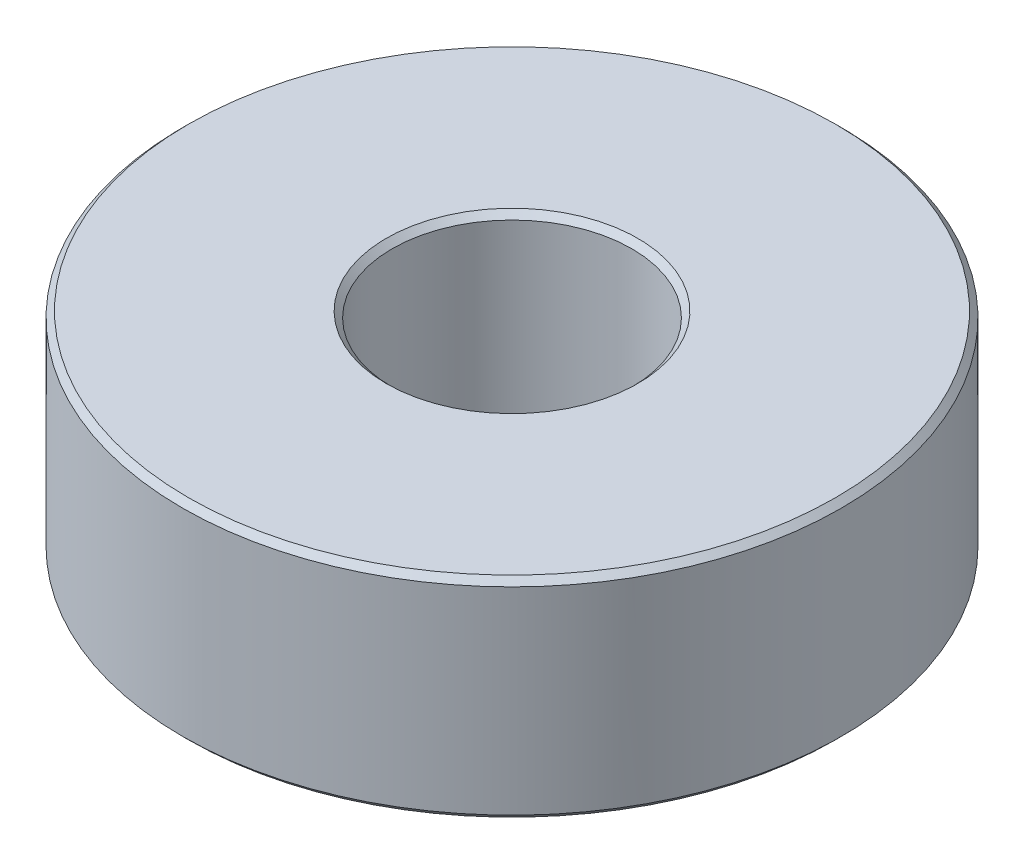
ISO-10303-21;
HEADER;
FILE_DESCRIPTION(('STEP AP214'),'2;1');
FILE_NAME('part.step','',(''),(''),'','','');
FILE_SCHEMA(('AUTOMOTIVE_DESIGN { 1 0 10303 214 1 1 1 1 }'));
ENDSEC;
DATA;
#1=APPLICATION_CONTEXT('core data for automotive mechanical design processes');
#2=APPLICATION_PROTOCOL_DEFINITION('international standard','automotive_design',2000,#1);
#3=PRODUCT_CONTEXT('',#1,'mechanical');
#4=PRODUCT('Part','Part','',(#3));
#5=PRODUCT_RELATED_PRODUCT_CATEGORY('part','',(#4));
#6=PRODUCT_DEFINITION_FORMATION('','',#4);
#7=PRODUCT_DEFINITION_CONTEXT('part definition',#1,'design');
#8=PRODUCT_DEFINITION('design','',#6,#7);
#9=PRODUCT_DEFINITION_SHAPE('','',#8);
#10=(LENGTH_UNIT() NAMED_UNIT(*) SI_UNIT(.MILLI.,.METRE.));
#11=(NAMED_UNIT(*) PLANE_ANGLE_UNIT() SI_UNIT($,.RADIAN.));
#12=(NAMED_UNIT(*) SI_UNIT($,.STERADIAN.) SOLID_ANGLE_UNIT());
#13=UNCERTAINTY_MEASURE_WITH_UNIT(LENGTH_MEASURE(1.E-05),#10,'distance_accuracy_value','');
#14=(GEOMETRIC_REPRESENTATION_CONTEXT(3) GLOBAL_UNCERTAINTY_ASSIGNED_CONTEXT((#13)) GLOBAL_UNIT_ASSIGNED_CONTEXT((#10,
#11,#12)) REPRESENTATION_CONTEXT('',''));
#15=CARTESIAN_POINT('',(0.,0.,0.));
#16=DIRECTION('',(0.,0.,1.));
#17=DIRECTION('',(1.,0.,0.));
#18=AXIS2_PLACEMENT_3D('',#15,#16,#17);
#19=CARTESIAN_POINT('',(0.,7.,0.));
#20=DIRECTION('',(0.,1.,0.));
#21=DIRECTION('',(0.,0.,1.));
#22=AXIS2_PLACEMENT_3D('',#19,#20,#21);
#23=CYLINDRICAL_SURFACE('',#22,4.);
#24=CARTESIAN_POINT('',(0.,0.200000000063483,0.));
#25=DIRECTION('',(0.,-1.,0.));
#26=DIRECTION('',(0.,0.,-1.));
#27=AXIS2_PLACEMENT_3D('',#24,#25,#26);
#28=CIRCLE('',#27,4.00000000007594);
#29=CARTESIAN_POINT('',(0.,0.200000000063483,-4.00000000007594));
#30=VERTEX_POINT('',#29);
#31=EDGE_CURVE('E36',#30,#30,#28,.T.);
#32=ORIENTED_EDGE('',*,*,#31,.T.);
#33=EDGE_LOOP('',(#32));
#34=FACE_BOUND('',#33,.T.);
#35=CARTESIAN_POINT('',(0.,6.79999999999836,0.));
#36=DIRECTION('',(0.,1.,0.));
#37=DIRECTION('',(0.,0.,1.));
#38=AXIS2_PLACEMENT_3D('',#35,#36,#37);
#39=CIRCLE('',#38,3.99999999996226);
#40=CARTESIAN_POINT('',(0.,6.79999999999836,3.99999999996226));
#41=VERTEX_POINT('',#40);
#42=EDGE_CURVE('E39',#41,#41,#39,.T.);
#43=ORIENTED_EDGE('',*,*,#42,.T.);
#44=EDGE_LOOP('',(#43));
#45=FACE_BOUND('',#44,.T.);
#46=ADVANCED_FACE('F17',(#34,#45),#23,.F.);
#47=CARTESIAN_POINT('',(0.,7.000000000005,0.));
#48=DIRECTION('',(0.,1.,0.));
#49=DIRECTION('',(0.,0.,1.));
#50=AXIS2_PLACEMENT_3D('',#47,#48,#49);
#51=CONICAL_SURFACE('',#50,4.1999999999689,0.785398163397448);
#52=ORIENTED_EDGE('',*,*,#42,.F.);
#53=EDGE_LOOP('',(#52));
#54=FACE_BOUND('',#53,.T.);
#55=CARTESIAN_POINT('',(0.,7.000000000005,0.));
#56=DIRECTION('',(0.,1.,0.));
#57=DIRECTION('',(0.,0.,1.));
#58=AXIS2_PLACEMENT_3D('',#55,#56,#57);
#59=CIRCLE('',#58,4.1999999999689);
#60=CARTESIAN_POINT('',(0.,7.000000000005,4.1999999999689));
#61=VERTEX_POINT('',#60);
#62=EDGE_CURVE('E20',#61,#61,#59,.F.);
#63=ORIENTED_EDGE('',*,*,#62,.F.);
#64=EDGE_LOOP('',(#63));
#65=FACE_BOUND('',#64,.T.);
#66=ADVANCED_FACE('F60',(#54,#65),#51,.F.);
#67=CARTESIAN_POINT('',(0.,1.70530256582424E-10,0.));
#68=DIRECTION('',(0.,-1.,0.));
#69=DIRECTION('',(0.,0.,-1.));
#70=AXIS2_PLACEMENT_3D('',#67,#68,#69);
#71=CONICAL_SURFACE('',#70,4.19999999991205,0.785398163397448);
#72=CARTESIAN_POINT('',(0.,5.6843418860808E-11,0.));
#73=DIRECTION('',(0.,-1.,0.));
#74=DIRECTION('',(0.,0.,-1.));
#75=AXIS2_PLACEMENT_3D('',#72,#73,#74);
#76=CIRCLE('',#75,4.20000000002574);
#77=CARTESIAN_POINT('',(0.,5.6843418860808E-11,-4.20000000002574));
#78=VERTEX_POINT('',#77);
#79=EDGE_CURVE('E50',#78,#78,#76,.T.);
#80=ORIENTED_EDGE('',*,*,#79,.T.);
#81=EDGE_LOOP('',(#80));
#82=FACE_BOUND('',#81,.T.);
#83=ORIENTED_EDGE('',*,*,#31,.F.);
#84=EDGE_LOOP('',(#83));
#85=FACE_BOUND('',#84,.T.);
#86=ADVANCED_FACE('F62',(#82,#85),#71,.F.);
#87=CARTESIAN_POINT('',(0.,7.,0.));
#88=DIRECTION('',(0.,1.,0.));
#89=DIRECTION('',(0.,0.,1.));
#90=AXIS2_PLACEMENT_3D('',#87,#88,#89);
#91=PLANE('',#90);
#92=ORIENTED_EDGE('',*,*,#62,.T.);
#93=EDGE_LOOP('',(#92));
#94=FACE_BOUND('',#93,.T.);
#95=CARTESIAN_POINT('',(0.,7.,0.));
#96=DIRECTION('',(0.,-1.,0.));
#97=DIRECTION('',(1.,0.,0.));
#98=AXIS2_PLACEMENT_3D('',#95,#96,#97);
#99=CIRCLE('',#98,10.8);
#100=CARTESIAN_POINT('',(10.8,7.,0.));
#101=VERTEX_POINT('',#100);
#102=EDGE_CURVE('E48',#101,#101,#99,.T.);
#103=ORIENTED_EDGE('',*,*,#102,.F.);
#104=EDGE_LOOP('',(#103));
#105=FACE_BOUND('',#104,.T.);
#106=ADVANCED_FACE('F57',(#94,#105),#91,.T.);
#107=CARTESIAN_POINT('',(0.,0.,0.));
#108=DIRECTION('',(0.,1.,0.));
#109=DIRECTION('',(0.,0.,1.));
#110=AXIS2_PLACEMENT_3D('',#107,#108,#109);
#111=PLANE('',#110);
#112=ORIENTED_EDGE('',*,*,#79,.F.);
#113=EDGE_LOOP('',(#112));
#114=FACE_BOUND('',#113,.T.);
#115=CARTESIAN_POINT('',(0.,0.,0.));
#116=DIRECTION('',(0.,1.,0.));
#117=DIRECTION('',(-1.,0.,0.));
#118=AXIS2_PLACEMENT_3D('',#115,#116,#117);
#119=CIRCLE('',#118,10.8);
#120=CARTESIAN_POINT('',(-10.8,0.,0.));
#121=VERTEX_POINT('',#120);
#122=EDGE_CURVE('E29',#121,#121,#119,.T.);
#123=ORIENTED_EDGE('',*,*,#122,.F.);
#124=EDGE_LOOP('',(#123));
#125=FACE_BOUND('',#124,.T.);
#126=ADVANCED_FACE('F86',(#114,#125),#111,.F.);
#127=CARTESIAN_POINT('',(0.,6.8,0.));
#128=DIRECTION('',(0.,-1.,0.));
#129=DIRECTION('',(1.,0.,0.));
#130=AXIS2_PLACEMENT_3D('',#127,#128,#129);
#131=CONICAL_SURFACE('',#130,11.,0.785398163397453);
#132=ORIENTED_EDGE('',*,*,#102,.T.);
#133=EDGE_LOOP('',(#132));
#134=FACE_BOUND('',#133,.T.);
#135=CARTESIAN_POINT('',(0.,6.8,0.));
#136=DIRECTION('',(0.,1.,0.));
#137=DIRECTION('',(0.,0.,1.));
#138=AXIS2_PLACEMENT_3D('',#135,#136,#137);
#139=CIRCLE('',#138,11.);
#140=CARTESIAN_POINT('',(0.,6.8,11.));
#141=VERTEX_POINT('',#140);
#142=EDGE_CURVE('E24',#141,#141,#139,.F.);
#143=ORIENTED_EDGE('',*,*,#142,.F.);
#144=EDGE_LOOP('',(#143));
#145=FACE_BOUND('',#144,.T.);
#146=ADVANCED_FACE('F79',(#134,#145),#131,.T.);
#147=CARTESIAN_POINT('',(0.,0.2,0.));
#148=DIRECTION('',(0.,1.,0.));
#149=DIRECTION('',(-1.,0.,0.));
#150=AXIS2_PLACEMENT_3D('',#147,#148,#149);
#151=CONICAL_SURFACE('',#150,11.,0.785398163397452);
#152=CARTESIAN_POINT('',(0.,0.2,0.));
#153=DIRECTION('',(0.,1.,0.));
#154=DIRECTION('',(0.,0.,1.));
#155=AXIS2_PLACEMENT_3D('',#152,#153,#154);
#156=CIRCLE('',#155,11.);
#157=CARTESIAN_POINT('',(0.,0.2,11.));
#158=VERTEX_POINT('',#157);
#159=EDGE_CURVE('E10',#158,#158,#156,.T.);
#160=ORIENTED_EDGE('',*,*,#159,.F.);
#161=EDGE_LOOP('',(#160));
#162=FACE_BOUND('',#161,.T.);
#163=ORIENTED_EDGE('',*,*,#122,.T.);
#164=EDGE_LOOP('',(#163));
#165=FACE_BOUND('',#164,.T.);
#166=ADVANCED_FACE('F74',(#162,#165),#151,.T.);
#167=CARTESIAN_POINT('',(0.,7.,0.));
#168=DIRECTION('',(0.,1.,0.));
#169=DIRECTION('',(0.,0.,1.));
#170=AXIS2_PLACEMENT_3D('',#167,#168,#169);
#171=CYLINDRICAL_SURFACE('',#170,11.);
#172=ORIENTED_EDGE('',*,*,#159,.T.);
#173=EDGE_LOOP('',(#172));
#174=FACE_BOUND('',#173,.T.);
#175=ORIENTED_EDGE('',*,*,#142,.T.);
#176=EDGE_LOOP('',(#175));
#177=FACE_BOUND('',#176,.T.);
#178=ADVANCED_FACE('F72',(#174,#177),#171,.T.);
#179=CLOSED_SHELL('',(#46,#66,#86,#106,#126,#146,#166,#178));
#180=MANIFOLD_SOLID_BREP('B1',#179);
#181=ADVANCED_BREP_SHAPE_REPRESENTATION('',(#18,#180),#14);
#182=SHAPE_DEFINITION_REPRESENTATION(#9,#181);
ENDSEC;
END-ISO-10303-21;
